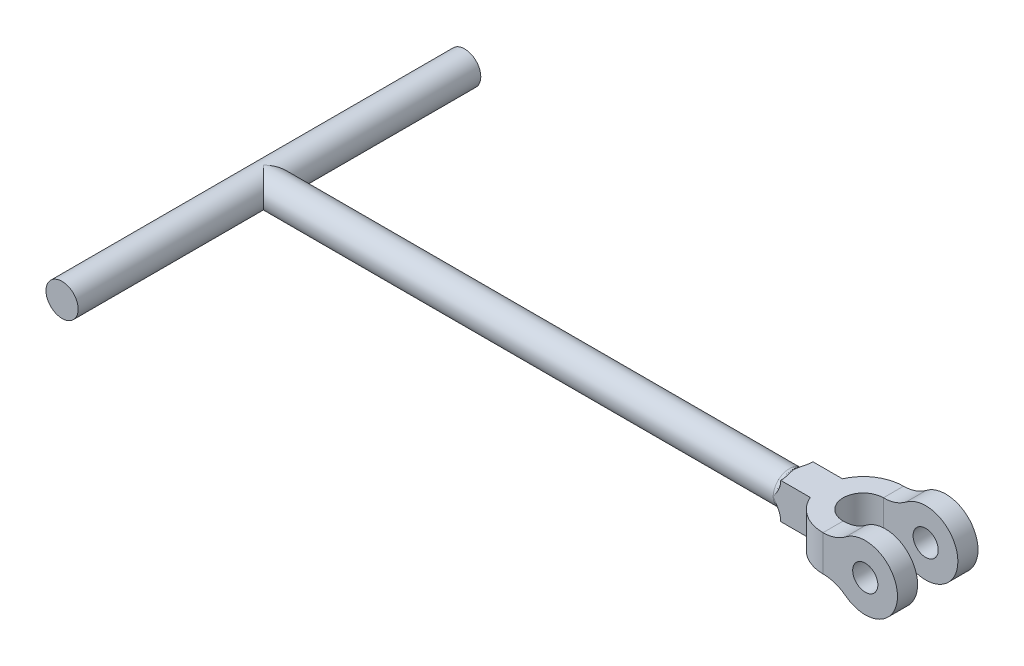
ISO-10303-21;
HEADER;
FILE_DESCRIPTION(('STEP AP214'),'2;1');
FILE_NAME('part.step','',(''),(''),'','','');
FILE_SCHEMA(('AUTOMOTIVE_DESIGN { 1 0 10303 214 1 1 1 1 }'));
ENDSEC;
DATA;
#1=APPLICATION_CONTEXT('core data for automotive mechanical design processes');
#2=APPLICATION_PROTOCOL_DEFINITION('international standard','automotive_design',2000,#1);
#3=PRODUCT_CONTEXT('',#1,'mechanical');
#4=PRODUCT('Part','Part','',(#3));
#5=PRODUCT_RELATED_PRODUCT_CATEGORY('part','',(#4));
#6=PRODUCT_DEFINITION_FORMATION('','',#4);
#7=PRODUCT_DEFINITION_CONTEXT('part definition',#1,'design');
#8=PRODUCT_DEFINITION('design','',#6,#7);
#9=PRODUCT_DEFINITION_SHAPE('','',#8);
#10=(LENGTH_UNIT() NAMED_UNIT(*) SI_UNIT(.MILLI.,.METRE.));
#11=(NAMED_UNIT(*) PLANE_ANGLE_UNIT() SI_UNIT($,.RADIAN.));
#12=(NAMED_UNIT(*) SI_UNIT($,.STERADIAN.) SOLID_ANGLE_UNIT());
#13=UNCERTAINTY_MEASURE_WITH_UNIT(LENGTH_MEASURE(1.E-05),#10,'distance_accuracy_value','');
#14=(GEOMETRIC_REPRESENTATION_CONTEXT(3) GLOBAL_UNCERTAINTY_ASSIGNED_CONTEXT((#13)) GLOBAL_UNIT_ASSIGNED_CONTEXT((#10,
#11,#12)) REPRESENTATION_CONTEXT('',''));
#15=CARTESIAN_POINT('',(0.,0.,0.));
#16=DIRECTION('',(0.,0.,1.));
#17=DIRECTION('',(1.,0.,0.));
#18=AXIS2_PLACEMENT_3D('',#15,#16,#17);
#19=CARTESIAN_POINT('',(-96.,17.75,0.));
#20=DIRECTION('',(1.,0.,0.));
#21=DIRECTION('',(0.,0.,-1.));
#22=AXIS2_PLACEMENT_3D('',#19,#20,#21);
#23=CYLINDRICAL_SURFACE('',#22,16.);
#24=CARTESIAN_POINT('',(-73.5,17.75,0.));
#25=DIRECTION('',(1.,0.,0.));
#26=DIRECTION('',(0.,0.,-1.));
#27=AXIS2_PLACEMENT_3D('',#24,#25,#26);
#28=CIRCLE('',#27,16.);
#29=CARTESIAN_POINT('',(-73.5,29.8351063829787,-10.4857142680929));
#30=VERTEX_POINT('',#29);
#31=CARTESIAN_POINT('',(-73.5,17.75,-16.));
#32=VERTEX_POINT('',#31);
#33=EDGE_CURVE('E359',#30,#32,#28,.F.);
#34=ORIENTED_EDGE('',*,*,#33,.T.);
#35=CARTESIAN_POINT('',(-73.5,17.75,0.));
#36=DIRECTION('',(1.,0.,0.));
#37=DIRECTION('',(0.,0.,-1.));
#38=AXIS2_PLACEMENT_3D('',#35,#36,#37);
#39=CIRCLE('',#38,16.);
#40=CARTESIAN_POINT('',(-73.5,17.75,16.));
#41=VERTEX_POINT('',#40);
#42=EDGE_CURVE('E403',#32,#41,#39,.F.);
#43=ORIENTED_EDGE('',*,*,#42,.T.);
#44=CARTESIAN_POINT('',(-73.5,17.75,0.));
#45=DIRECTION('',(1.,0.,0.));
#46=DIRECTION('',(0.,0.,-1.));
#47=AXIS2_PLACEMENT_3D('',#44,#45,#46);
#48=CIRCLE('',#47,16.);
#49=EDGE_CURVE('E355',#41,#30,#48,.F.);
#50=ORIENTED_EDGE('',*,*,#49,.T.);
#51=EDGE_LOOP('',(#34,#43,#50));
#52=FACE_BOUND('',#51,.T.);
#53=CARTESIAN_POINT('',(-596.,17.75,2.54136989230602E-13));
#54=DIRECTION('',(0.707106781186547,0.,-0.707106781186548));
#55=DIRECTION('',(0.707106781186548,0.,0.707106781186547));
#56=AXIS2_PLACEMENT_3D('',#53,#54,#55);
#57=ELLIPSE('',#56,22.6274169979695,16.);
#58=CARTESIAN_POINT('',(-596.,1.75000000000003,2.4980018054066E-13));
#59=VERTEX_POINT('',#58);
#60=CARTESIAN_POINT('',(-596.,33.75,2.58473797920544E-13));
#61=VERTEX_POINT('',#60);
#62=EDGE_CURVE('E173',#59,#61,#57,.F.);
#63=ORIENTED_EDGE('',*,*,#62,.F.);
#64=CARTESIAN_POINT('',(-596.,17.75,2.54136989230602E-13));
#65=DIRECTION('',(0.707106781186548,0.,0.707106781186547));
#66=DIRECTION('',(0.707106781186547,0.,-0.707106781186548));
#67=AXIS2_PLACEMENT_3D('',#64,#65,#66);
#68=ELLIPSE('',#67,22.6274169979695,16.);
#69=EDGE_CURVE('E64',#61,#59,#68,.F.);
#70=ORIENTED_EDGE('',*,*,#69,.F.);
#71=EDGE_LOOP('',(#63,#70));
#72=FACE_BOUND('',#71,.T.);
#73=ADVANCED_FACE('F43',(#52,#72),#23,.T.);
#74=CARTESIAN_POINT('',(-73.5,17.75,0.));
#75=DIRECTION('',(1.,0.,0.));
#76=DIRECTION('',(0.,0.,-1.));
#77=AXIS2_PLACEMENT_3D('',#74,#75,#76);
#78=TOROIDAL_SURFACE('',#77,23.5,7.5);
#79=CARTESIAN_POINT('',(-66.,0.,15.4008928312615));
#80=CARTESIAN_POINT('',(-66.0000318023038,0.,14.8804115279279));
#81=CARTESIAN_POINT('',(-66.0232421290868,0.,14.3605790569439));
#82=CARTESIAN_POINT('',(-66.1081118865129,0.,13.3248495363233));
#83=CARTESIAN_POINT('',(-66.1697064153088,0.,12.808947328635));
#84=CARTESIAN_POINT('',(-66.3249199775155,0.,11.7723967458196));
#85=CARTESIAN_POINT('',(-66.4191134174114,0.,11.2518386026303));
#86=CARTESIAN_POINT('',(-66.6310759562392,0.,10.2155511707945));
#87=CARTESIAN_POINT('',(-66.748849536139,0.,9.69982281948884));
#88=CARTESIAN_POINT('',(-66.980504953852,0.,8.74942261622406));
#89=CARTESIAN_POINT('',(-67.0923061571591,0.,8.3142301774926));
#90=CARTESIAN_POINT('',(-67.3208962118078,0.,7.44514278697411));
#91=CARTESIAN_POINT('',(-67.4376854372865,0.,7.0112479351364));
#92=CARTESIAN_POINT('',(-67.66971628205,0.,6.14245178812685));
#93=CARTESIAN_POINT('',(-67.7849557813362,0.,5.7075499129907));
#94=CARTESIAN_POINT('',(-68.0057969348732,0.,4.83520444025799));
#95=CARTESIAN_POINT('',(-68.1113976406471,0.,4.39776059702188));
#96=CARTESIAN_POINT('',(-68.3012410377478,0.,3.5289026092728));
#97=CARTESIAN_POINT('',(-68.3859296587516,0.,3.09759042482606));
#98=CARTESIAN_POINT('',(-68.4921825004679,0.,2.4472500421156));
#99=CARTESIAN_POINT('',(-68.5241351172993,0.,2.22992464101352));
#100=CARTESIAN_POINT('',(-68.580031572255,0.,1.79425590315082));
#101=CARTESIAN_POINT('',(-68.6039762812246,0.,1.57591267969669));
#102=CARTESIAN_POINT('',(-68.642877661863,0.,1.13921693897396));
#103=CARTESIAN_POINT('',(-68.6578666663174,0.,0.920867336460486));
#104=CARTESIAN_POINT('',(-68.6783828273923,0.,0.483717759812868));
#105=CARTESIAN_POINT('',(-68.6839099716776,0.,0.264917785091952));
#106=CARTESIAN_POINT('',(-68.685266886859,0.,-0.172707607674446));
#107=CARTESIAN_POINT('',(-68.6810969054587,0.,-0.391533024927247));
#108=CARTESIAN_POINT('',(-68.6632403592593,0.,-0.828779650988105));
#109=CARTESIAN_POINT('',(-68.6495541414388,0.,-1.04720087424265));
#110=CARTESIAN_POINT('',(-68.6091042409076,0.,-1.53266984290301));
#111=CARTESIAN_POINT('',(-68.5800810764188,0.,-1.79952914195572));
#112=CARTESIAN_POINT('',(-68.510197221665,0.,-2.33162624017202));
#113=CARTESIAN_POINT('',(-68.4693380036541,0.,-2.59686423681762));
#114=CARTESIAN_POINT('',(-68.3777261065161,0.,-3.12619414766387));
#115=CARTESIAN_POINT('',(-68.3269521416921,0.,-3.39028232369009));
#116=CARTESIAN_POINT('',(-68.217741284752,0.,-3.91685724088286));
#117=CARTESIAN_POINT('',(-68.159304119703,0.,-4.17934392466198));
#118=CARTESIAN_POINT('',(-68.0356870934936,0.,-4.70812420837128));
#119=CARTESIAN_POINT('',(-67.9703977561242,0.,-4.97439192300044));
#120=CARTESIAN_POINT('',(-67.8361288430587,0.,-5.50598255092246));
#121=CARTESIAN_POINT('',(-67.7671493040497,0.,-5.77130547358025));
#122=CARTESIAN_POINT('',(-67.6274306153857,0.,-6.30124759880482));
#123=CARTESIAN_POINT('',(-67.5566929767522,0.,-6.56586720310252));
#124=CARTESIAN_POINT('',(-67.4150795900988,0.,-7.09506944346952));
#125=CARTESIAN_POINT('',(-67.3442038415767,0.,-7.35965207940065));
#126=CARTESIAN_POINT('',(-67.1951607858698,0.,-7.92189564390278));
#127=CARTESIAN_POINT('',(-67.1171743097998,0.,-8.21960523746512));
#128=CARTESIAN_POINT('',(-66.964895115067,0.,-8.81596427977908));
#129=CARTESIAN_POINT('',(-66.8906023785395,0.,-9.1146137239777));
#130=CARTESIAN_POINT('',(-66.6759428035398,0.,-10.0127757147645));
#131=CARTESIAN_POINT('',(-66.5438406161752,0.,-10.6143365876824));
#132=CARTESIAN_POINT('',(-66.316643111206,0.,-11.8161813447402));
#133=CARTESIAN_POINT('',(-66.2210677237878,0.,-12.4163707840733));
#134=CARTESIAN_POINT('',(-66.0767821461099,0.,-13.6222065429027));
#135=CARTESIAN_POINT('',(-66.0280449458546,0.,-14.2278495138802));
#136=CARTESIAN_POINT('',(-65.9873989377953,0.,-15.5223054349925));
#137=CARTESIAN_POINT('',(-66.0038815495804,0.,-16.211498914849));
#138=CARTESIAN_POINT('',(-66.1002815084626,0.,-17.2445427915309));
#139=CARTESIAN_POINT('',(-66.1450646661702,0.,-17.591746516269));
#140=CARTESIAN_POINT('',(-66.2617241135336,0.,-18.2820799720931));
#141=CARTESIAN_POINT('',(-66.3336416538249,0.,-18.6252026756827));
#142=CARTESIAN_POINT('',(-66.4203362118473,0.,-18.9648841961865));
#143=B_SPLINE_CURVE_WITH_KNOTS('',3,(#79,#80,#81,#82,#83,#84,#85,#86,#87,#88,#89,#90,#91,#92,
#93,#94,#95,#96,#97,#98,#99,#100,#101,#102,#103,#104,#105,#106,#107,#108,#109,#110,#111,#112,
#113,#114,#115,#116,#117,#118,#119,#120,#121,#122,#123,#124,#125,#126,#127,#128,#129,#130,#131,
#132,#133,#134,#135,#136,#137,#138,#139,#140,#141,#142),.UNSPECIFIED.,.F.,.F.,(4,2,2,2,2,2,2,2,
2,2,2,2,2,2,2,2,2,2,2,2,2,2,2,2,2,2,2,2,2,2,2,4),(0.,1.56000017940334,3.11736976603774,
4.70370956666008,6.29035110831758,7.63826642291521,8.98628301890779,10.3359868394177,
11.6858233306618,13.0037462948952,13.6626070403594,14.3213961125971,14.9777921565568,
15.634189056243,16.290569189089,16.9469253904172,17.7519052159296,18.556784955176,
19.3634120529026,20.170067887294,20.992492274497,21.8149084868714,22.6366407665604,
23.4583760396232,24.3816216755832,25.3048628458463,27.1518598189369,28.9736707385696,
30.7944304500574,32.8565978470415,33.905876140512,34.956756053112),.UNSPECIFIED.);
#144=CARTESIAN_POINT('',(-66.,0.,15.4008928312615));
#145=VERTEX_POINT('',#144);
#146=CARTESIAN_POINT('',(-66.,0.,-15.4008928312614));
#147=VERTEX_POINT('',#146);
#148=EDGE_CURVE('E396',#145,#147,#143,.T.);
#149=ORIENTED_EDGE('',*,*,#148,.F.);
#150=CARTESIAN_POINT('',(-66.,17.75,0.));
#151=DIRECTION('',(1.,0.,0.));
#152=DIRECTION('',(0.,0.,-1.));
#153=AXIS2_PLACEMENT_3D('',#150,#151,#152);
#154=CIRCLE('',#153,23.5);
#155=CARTESIAN_POINT('',(-66.,0.538085521941473,16.));
#156=VERTEX_POINT('',#155);
#157=EDGE_CURVE('E426',#156,#145,#154,.T.);
#158=ORIENTED_EDGE('',*,*,#157,.F.);
#159=CARTESIAN_POINT('',(-66.,0.538085521941473,16.));
#160=CARTESIAN_POINT('',(-66.0000377689396,1.00016842260866,16.));
#161=CARTESIAN_POINT('',(-66.0228927360209,1.46178647270298,16.));
#162=CARTESIAN_POINT('',(-66.1092220185612,2.38036181063382,16.));
#163=CARTESIAN_POINT('',(-66.1726164006055,2.83732647642499,16.));
#164=CARTESIAN_POINT('',(-66.333617997605,3.73671185793217,16.));
#165=CARTESIAN_POINT('',(-66.4306029457875,4.17924697725201,16.));
#166=CARTESIAN_POINT('',(-66.6547296331058,5.05676315942903,16.));
#167=CARTESIAN_POINT('',(-66.7818861741718,5.49174040168725,16.));
#168=CARTESIAN_POINT('',(-67.0959496714085,6.45631626876657,16.));
#169=CARTESIAN_POINT('',(-67.2898730591803,6.98362027030848,16.));
#170=CARTESIAN_POINT('',(-67.7110842399745,8.02484474667585,16.));
#171=CARTESIAN_POINT('',(-67.938387698479,8.53875880344787,16.));
#172=CARTESIAN_POINT('',(-68.4205544766813,9.55443918313024,16.));
#173=CARTESIAN_POINT('',(-68.6754632112109,10.0561837737627,16.));
#174=CARTESIAN_POINT('',(-69.2069770502382,11.0478698338466,16.));
#175=CARTESIAN_POINT('',(-69.4835792613762,11.5378128659715,16.));
#176=CARTESIAN_POINT('',(-70.3438417035465,13.001932274059,16.));
#177=CARTESIAN_POINT('',(-70.9532194674221,13.9608815531865,16.0000000000001));
#178=CARTESIAN_POINT('',(-72.20360947692,15.8562716536274,15.9999999999999));
#179=CARTESIAN_POINT('',(-72.8446009215682,16.7927266878886,15.9999999999995));
#180=CARTESIAN_POINT('',(-73.4904721387591,17.736083666427,16.));
#181=CARTESIAN_POINT('',(-73.4952360694397,17.7430418325346,16.));
#182=CARTESIAN_POINT('',(-73.5,17.75,16.));
#183=B_SPLINE_CURVE_WITH_KNOTS('',3,(#159,#160,#161,#162,#163,#164,#165,#166,#167,#168,#169,
#170,#171,#172,#173,#174,#175,#176,#177,#178,#179,#180,#181,#182),.UNSPECIFIED.,.F.,.F.,(4,2,2,
2,2,2,2,2,2,2,2,4),(0.,1.38501867528732,2.76731483125574,4.12526422260894,5.48388119498472,
7.16795908207809,8.85282985860789,10.540515864966,12.2279771583539,15.6347092668108,
19.0392289851502,19.0645272064318),.UNSPECIFIED.);
#184=EDGE_CURVE('E58',#156,#41,#183,.T.);
#185=ORIENTED_EDGE('',*,*,#184,.T.);
#186=ORIENTED_EDGE('',*,*,#42,.F.);
#187=CARTESIAN_POINT('',(-66.,0.538085521941515,-16.));
#188=CARTESIAN_POINT('',(-66.0000377689396,1.00016842257633,-16.));
#189=CARTESIAN_POINT('',(-66.0228927360177,1.4617864726384,-16.));
#190=CARTESIAN_POINT('',(-66.1092220185469,2.38036181051253,-16.));
#191=CARTESIAN_POINT('',(-66.172616400584,2.83732647627918,-16.));
#192=CARTESIAN_POINT('',(-66.3336179975758,3.73671185779374,-16.));
#193=CARTESIAN_POINT('',(-66.4306029457619,4.17924697714469,-16.));
#194=CARTESIAN_POINT('',(-66.654729633091,5.05676315937838,-16.));
#195=CARTESIAN_POINT('',(-66.7818861741636,5.49174040166226,-16.));
#196=CARTESIAN_POINT('',(-67.0959496714101,6.45631626877129,-16.));
#197=CARTESIAN_POINT('',(-67.2898730591841,6.98362027031759,-16.));
#198=CARTESIAN_POINT('',(-67.7110842399823,8.02484474669548,-16.));
#199=CARTESIAN_POINT('',(-67.9383876984887,8.53875880347361,-16.));
#200=CARTESIAN_POINT('',(-68.4205544767055,9.55443918317596,-16.));
#201=CARTESIAN_POINT('',(-68.6754632112485,10.056183773822,-16.));
#202=CARTESIAN_POINT('',(-69.206977050284,11.0478698339428,-16.));
#203=CARTESIAN_POINT('',(-69.4835792614167,11.5378128660911,-16.));
#204=CARTESIAN_POINT('',(-70.3438417036505,13.0019322741342,-16.));
#205=CARTESIAN_POINT('',(-70.9532194676982,13.9608815531227,-15.9999999999998));
#206=CARTESIAN_POINT('',(-72.2036094767323,15.8562716538254,-16.0000000000002));
#207=CARTESIAN_POINT('',(-72.8446009207447,16.7927266884872,-16.0000000000006));
#208=CARTESIAN_POINT('',(-73.4904721387467,17.7360836664356,-16.));
#209=CARTESIAN_POINT('',(-73.4952360694335,17.7430418325389,-16.));
#210=CARTESIAN_POINT('',(-73.5,17.75,-16.));
#211=B_SPLINE_CURVE_WITH_KNOTS('',3,(#187,#188,#189,#190,#191,#192,#193,#194,#195,#196,#197,
#198,#199,#200,#201,#202,#203,#204,#205,#206,#207,#208,#209,#210),.UNSPECIFIED.,.F.,.F.,(4,2,2,
2,2,2,2,2,2,2,2,4),(0.,1.38501867519049,2.76731483108334,4.12526422252981,5.4838811949848,
7.167959082093,8.85282985864112,10.5405158650554,12.2279771584922,15.6347092668967,
19.0392289851505,19.0645272064319),.UNSPECIFIED.);
#212=CARTESIAN_POINT('',(-66.,0.538085521941515,-16.));
#213=VERTEX_POINT('',#212);
#214=EDGE_CURVE('E11',#32,#213,#211,.F.);
#215=ORIENTED_EDGE('',*,*,#214,.T.);
#216=CARTESIAN_POINT('',(-66.,17.75,0.));
#217=DIRECTION('',(1.,0.,0.));
#218=DIRECTION('',(0.,0.,-1.));
#219=AXIS2_PLACEMENT_3D('',#216,#217,#218);
#220=CIRCLE('',#219,23.5);
#221=EDGE_CURVE('E423',#147,#213,#220,.T.);
#222=ORIENTED_EDGE('',*,*,#221,.F.);
#223=EDGE_LOOP('',(#149,#158,#185,#186,#215,#222));
#224=FACE_BOUND('',#223,.T.);
#225=ADVANCED_FACE('F45',(#224),#78,.F.);
#226=CARTESIAN_POINT('',(-66.,35.5,-16.));
#227=DIRECTION('',(1.,0.,0.));
#228=DIRECTION('',(0.,0.,-1.));
#229=AXIS2_PLACEMENT_3D('',#226,#227,#228);
#230=PLANE('',#229);
#231=DIRECTION('',(0.,-1.,0.));
#232=VECTOR('',#231,1.);
#233=CARTESIAN_POINT('',(-66.,35.5,16.));
#234=LINE('',#233,#232);
#235=CARTESIAN_POINT('',(-66.,0.,16.));
#236=VERTEX_POINT('',#235);
#237=EDGE_CURVE('E325',#156,#236,#234,.T.);
#238=ORIENTED_EDGE('',*,*,#237,.F.);
#239=ORIENTED_EDGE('',*,*,#157,.T.);
#240=DIRECTION('',(0.,0.,1.));
#241=VECTOR('',#240,1.);
#242=CARTESIAN_POINT('',(-66.,0.,-16.));
#243=LINE('',#242,#241);
#244=EDGE_CURVE('E300',#145,#236,#243,.T.);
#245=ORIENTED_EDGE('',*,*,#244,.T.);
#246=EDGE_LOOP('',(#238,#239,#245));
#247=FACE_BOUND('',#246,.T.);
#248=ADVANCED_FACE('F510',(#247),#230,.F.);
#249=CARTESIAN_POINT('',(-73.5,17.75,0.));
#250=DIRECTION('',(1.,0.,0.));
#251=DIRECTION('',(0.,0.,-1.));
#252=AXIS2_PLACEMENT_3D('',#249,#250,#251);
#253=TOROIDAL_SURFACE('',#252,23.5,7.5);
#254=CARTESIAN_POINT('',(-66.,35.5,-15.4008928312614));
#255=CARTESIAN_POINT('',(-66.0000318023038,35.5,-14.8804115279278));
#256=CARTESIAN_POINT('',(-66.0232421290868,35.5,-14.3605790569439));
#257=CARTESIAN_POINT('',(-66.108111886513,35.5,-13.3248495363233));
#258=CARTESIAN_POINT('',(-66.1697064153088,35.5,-12.8089473286349));
#259=CARTESIAN_POINT('',(-66.3249199775155,35.5,-11.7723967458196));
#260=CARTESIAN_POINT('',(-66.4191134174114,35.5,-11.2518386026302));
#261=CARTESIAN_POINT('',(-66.6310759562392,35.5,-10.2155511707944));
#262=CARTESIAN_POINT('',(-66.748849536139,35.5,-9.6998228194888));
#263=CARTESIAN_POINT('',(-66.980504953852,35.5,-8.74942261622402));
#264=CARTESIAN_POINT('',(-67.0923061571591,35.5,-8.31423017749256));
#265=CARTESIAN_POINT('',(-67.3208962118078,35.5,-7.44514278697407));
#266=CARTESIAN_POINT('',(-67.4376854372865,35.5,-7.01124793513635));
#267=CARTESIAN_POINT('',(-67.66971628205,35.5,-6.1424517881268));
#268=CARTESIAN_POINT('',(-67.7849557813362,35.5,-5.70754991299066));
#269=CARTESIAN_POINT('',(-68.0057969348732,35.5,-4.83520444025795));
#270=CARTESIAN_POINT('',(-68.1113976406471,35.5,-4.39776059702184));
#271=CARTESIAN_POINT('',(-68.3012410377478,35.5,-3.52890260927276));
#272=CARTESIAN_POINT('',(-68.3859296587516,35.5,-3.09759042482602));
#273=CARTESIAN_POINT('',(-68.4921825004679,35.5,-2.44725004211555));
#274=CARTESIAN_POINT('',(-68.5241351172993,35.5,-2.22992464101347));
#275=CARTESIAN_POINT('',(-68.580031572255,35.5,-1.79425590315078));
#276=CARTESIAN_POINT('',(-68.6039762812246,35.5,-1.57591267969665));
#277=CARTESIAN_POINT('',(-68.642877661863,35.5,-1.13921693897392));
#278=CARTESIAN_POINT('',(-68.6578666663174,35.5,-0.920867336460447));
#279=CARTESIAN_POINT('',(-68.6783828273923,35.5,-0.483717759812829));
#280=CARTESIAN_POINT('',(-68.6839099716776,35.5,-0.264917785091914));
#281=CARTESIAN_POINT('',(-68.685266886859,35.5,0.172707607674483));
#282=CARTESIAN_POINT('',(-68.6810969054587,35.5,0.391533024927283));
#283=CARTESIAN_POINT('',(-68.6632403592593,35.5,0.828779650988141));
#284=CARTESIAN_POINT('',(-68.6495541414388,35.5,1.04720087424269));
#285=CARTESIAN_POINT('',(-68.6091042409076,35.5,1.53266984290304));
#286=CARTESIAN_POINT('',(-68.5800810764188,35.5,1.79952914195576));
#287=CARTESIAN_POINT('',(-68.510197221665,35.5,2.33162624017205));
#288=CARTESIAN_POINT('',(-68.4693380036541,35.5,2.59686423681764));
#289=CARTESIAN_POINT('',(-68.3777261065161,35.5,3.12619414766389));
#290=CARTESIAN_POINT('',(-68.3269521416921,35.5,3.39028232369011));
#291=CARTESIAN_POINT('',(-68.217741284752,35.5,3.91685724088287));
#292=CARTESIAN_POINT('',(-68.159304119703,35.5,4.17934392466198));
#293=CARTESIAN_POINT('',(-68.0356870934936,35.5,4.70812420837128));
#294=CARTESIAN_POINT('',(-67.9703977561242,35.5,4.97439192300044));
#295=CARTESIAN_POINT('',(-67.8361288430587,35.5,5.50598255092244));
#296=CARTESIAN_POINT('',(-67.7671493040497,35.5,5.77130547358023));
#297=CARTESIAN_POINT('',(-67.6274306153857,35.5,6.30124759880479));
#298=CARTESIAN_POINT('',(-67.5566929767522,35.5,6.56586720310249));
#299=CARTESIAN_POINT('',(-67.4150795900988,35.5,7.09506944346949));
#300=CARTESIAN_POINT('',(-67.3442038415767,35.5,7.35965207940061));
#301=CARTESIAN_POINT('',(-67.1951607858699,35.5,7.92189564390273));
#302=CARTESIAN_POINT('',(-67.1171743097998,35.5,8.21960523746507));
#303=CARTESIAN_POINT('',(-66.964895115067,35.5,8.81596427977902));
#304=CARTESIAN_POINT('',(-66.8906023785395,35.5,9.11461372397763));
#305=CARTESIAN_POINT('',(-66.6759428035398,35.5,10.0127757147645));
#306=CARTESIAN_POINT('',(-66.5438406161752,35.5,10.6143365876823));
#307=CARTESIAN_POINT('',(-66.316643111206,35.5,11.8161813447401));
#308=CARTESIAN_POINT('',(-66.2210677237879,35.5,12.4163707840732));
#309=CARTESIAN_POINT('',(-66.0767821461099,35.5,13.6222065429025));
#310=CARTESIAN_POINT('',(-66.0280449458546,35.5,14.2278495138801));
#311=CARTESIAN_POINT('',(-65.9873989377953,35.5,15.5223054349924));
#312=CARTESIAN_POINT('',(-66.0038815495804,35.5,16.2114989148489));
#313=CARTESIAN_POINT('',(-66.1002815084625,35.5,17.2445427915308));
#314=CARTESIAN_POINT('',(-66.1450646661701,35.5,17.5917465162689));
#315=CARTESIAN_POINT('',(-66.2617241135335,35.5,18.2820799720931));
#316=CARTESIAN_POINT('',(-66.3336416538248,35.5,18.6252026756826));
#317=CARTESIAN_POINT('',(-66.4203362118472,35.5,18.9648841961864));
#318=B_SPLINE_CURVE_WITH_KNOTS('',3,(#254,#255,#256,#257,#258,#259,#260,#261,#262,#263,#264,
#265,#266,#267,#268,#269,#270,#271,#272,#273,#274,#275,#276,#277,#278,#279,#280,#281,#282,#283,
#284,#285,#286,#287,#288,#289,#290,#291,#292,#293,#294,#295,#296,#297,#298,#299,#300,#301,#302,
#303,#304,#305,#306,#307,#308,#309,#310,#311,#312,#313,#314,#315,#316,#317),.UNSPECIFIED.,.F.,
.F.,(4,2,2,2,2,2,2,2,2,2,2,2,2,2,2,2,2,2,2,2,2,2,2,2,2,2,2,2,2,2,2,4),(0.,1.56000017940334,
3.11736976603773,4.70370956666007,6.29035110831756,7.63826642291519,8.98628301890778,
10.3359868394176,11.6858233306618,13.0037462948952,13.6626070403594,14.3213961125971,
14.9777921565568,15.634189056243,16.290569189089,16.9469253904172,17.7519052159296,
18.556784955176,19.3634120529026,20.170067887294,20.9924922744969,21.8149084868713,
22.6366407665603,23.4583760396231,24.3816216755831,25.3048628458462,27.1518598189368,
28.9736707385694,30.7944304500571,32.8565978470413,33.9058761405119,34.9567560531119),.UNSPECIFIED.);
#319=CARTESIAN_POINT('',(-66.,35.5,-15.4008928312614));
#320=VERTEX_POINT('',#319);
#321=CARTESIAN_POINT('',(-66.,35.5,15.4008928312615));
#322=VERTEX_POINT('',#321);
#323=EDGE_CURVE('E363',#320,#322,#318,.T.);
#324=ORIENTED_EDGE('',*,*,#323,.F.);
#325=CARTESIAN_POINT('',(-66.,17.75,0.));
#326=DIRECTION('',(1.,0.,0.));
#327=DIRECTION('',(0.,0.,-1.));
#328=AXIS2_PLACEMENT_3D('',#325,#326,#327);
#329=CIRCLE('',#328,23.5);
#330=CARTESIAN_POINT('',(-66.,34.9619144780585,-16.));
#331=VERTEX_POINT('',#330);
#332=EDGE_CURVE('E351',#331,#320,#329,.T.);
#333=ORIENTED_EDGE('',*,*,#332,.F.);
#334=CARTESIAN_POINT('',(-66.,34.9619144780585,-16.));
#335=CARTESIAN_POINT('',(-66.0000377689396,34.4998315774236,-16.));
#336=CARTESIAN_POINT('',(-66.0228927360177,34.0382135273616,-16.));
#337=CARTESIAN_POINT('',(-66.1092220185469,33.1196381894874,-16.));
#338=CARTESIAN_POINT('',(-66.172616400584,32.6626735237208,-16.));
#339=CARTESIAN_POINT('',(-66.3336179975758,31.7632881422062,-16.));
#340=CARTESIAN_POINT('',(-66.4306029457619,31.3207530228553,-16.));
#341=CARTESIAN_POINT('',(-66.654729633091,30.4432368406216,-16.));
#342=CARTESIAN_POINT('',(-66.7818861741636,30.0082595983377,-16.));
#343=CARTESIAN_POINT('',(-67.0959496714101,29.0436837312287,-16.));
#344=CARTESIAN_POINT('',(-67.2898730591841,28.5163797296824,-16.));
#345=CARTESIAN_POINT('',(-67.7110842399823,27.4751552533045,-16.));
#346=CARTESIAN_POINT('',(-67.9383876984887,26.9612411965264,-16.));
#347=CARTESIAN_POINT('',(-68.4205544767055,25.945560816824,-16.));
#348=CARTESIAN_POINT('',(-68.6754632112485,25.443816226178,-16.));
#349=CARTESIAN_POINT('',(-69.206977050284,24.4521301660572,-16.));
#350=CARTESIAN_POINT('',(-69.4835792614167,23.9621871339089,-16.));
#351=CARTESIAN_POINT('',(-70.3438417036505,22.4980677258658,-16.));
#352=CARTESIAN_POINT('',(-70.9532194676982,21.5391184468772,-15.9999999999998));
#353=CARTESIAN_POINT('',(-72.2036094767323,19.6437283461746,-16.0000000000002));
#354=CARTESIAN_POINT('',(-72.8446009207448,18.7072733115129,-16.0000000000006));
#355=CARTESIAN_POINT('',(-73.4904721387467,17.7639163335644,-16.));
#356=CARTESIAN_POINT('',(-73.4952360694335,17.7569581674611,-16.));
#357=CARTESIAN_POINT('',(-73.5,17.75,-16.));
#358=B_SPLINE_CURVE_WITH_KNOTS('',3,(#334,#335,#336,#337,#338,#339,#340,#341,#342,#343,#344,
#345,#346,#347,#348,#349,#350,#351,#352,#353,#354,#355,#356,#357),.UNSPECIFIED.,.F.,.F.,(4,2,2,
2,2,2,2,2,2,2,2,4),(0.,1.38501867519051,2.76731483108337,4.12526422252983,5.48388119498481,
7.16795908209301,8.85282985864112,10.5405158650554,12.2279771584922,15.6347092668967,
19.0392289851505,19.0645272064319),.UNSPECIFIED.);
#359=EDGE_CURVE('E371',#331,#32,#358,.T.);
#360=ORIENTED_EDGE('',*,*,#359,.T.);
#361=ORIENTED_EDGE('',*,*,#33,.F.);
#362=ORIENTED_EDGE('',*,*,#49,.F.);
#363=CARTESIAN_POINT('',(-66.,34.9619144780585,16.));
#364=CARTESIAN_POINT('',(-66.0000377689396,34.4998315773913,16.));
#365=CARTESIAN_POINT('',(-66.0228927360209,34.038213527297,16.));
#366=CARTESIAN_POINT('',(-66.1092220185612,33.1196381893662,16.));
#367=CARTESIAN_POINT('',(-66.1726164006055,32.662673523575,16.));
#368=CARTESIAN_POINT('',(-66.3336179976051,31.7632881420678,16.));
#369=CARTESIAN_POINT('',(-66.4306029457875,31.320753022748,16.));
#370=CARTESIAN_POINT('',(-66.6547296331058,30.443236840571,16.));
#371=CARTESIAN_POINT('',(-66.7818861741718,30.0082595983127,16.));
#372=CARTESIAN_POINT('',(-67.0959496714085,29.0436837312334,16.));
#373=CARTESIAN_POINT('',(-67.2898730591803,28.5163797296915,16.));
#374=CARTESIAN_POINT('',(-67.7110842399745,27.4751552533241,16.));
#375=CARTESIAN_POINT('',(-67.938387698479,26.9612411965521,16.));
#376=CARTESIAN_POINT('',(-68.4205544766813,25.9455608168697,16.));
#377=CARTESIAN_POINT('',(-68.6754632112109,25.4438162262373,16.));
#378=CARTESIAN_POINT('',(-69.2069770502383,24.4521301661534,16.));
#379=CARTESIAN_POINT('',(-69.4835792613762,23.9621871340285,16.));
#380=CARTESIAN_POINT('',(-70.3438417035466,22.498067725941,16.));
#381=CARTESIAN_POINT('',(-70.9532194674221,21.5391184468134,16.0000000000001));
#382=CARTESIAN_POINT('',(-72.20360947692,19.6437283463726,15.9999999999999));
#383=CARTESIAN_POINT('',(-72.8446009215682,18.7072733121114,15.9999999999995));
#384=CARTESIAN_POINT('',(-73.4904721387591,17.763916333573,16.));
#385=CARTESIAN_POINT('',(-73.4952360694397,17.7569581674654,16.));
#386=CARTESIAN_POINT('',(-73.5,17.75,16.));
#387=B_SPLINE_CURVE_WITH_KNOTS('',3,(#363,#364,#365,#366,#367,#368,#369,#370,#371,#372,#373,
#374,#375,#376,#377,#378,#379,#380,#381,#382,#383,#384,#385,#386),.UNSPECIFIED.,.F.,.F.,(4,2,2,
2,2,2,2,2,2,2,2,4),(0.,1.38501867528732,2.76731483125576,4.12526422260895,5.48388119498473,
7.1679590820781,8.8528298586079,10.5405158649661,12.2279771583539,15.6347092668108,
19.0392289851502,19.0645272064318),.UNSPECIFIED.);
#388=CARTESIAN_POINT('',(-66.,34.9619144780585,16.));
#389=VERTEX_POINT('',#388);
#390=EDGE_CURVE('E416',#41,#389,#387,.F.);
#391=ORIENTED_EDGE('',*,*,#390,.T.);
#392=CARTESIAN_POINT('',(-66.,17.75,0.));
#393=DIRECTION('',(1.,0.,0.));
#394=DIRECTION('',(0.,0.,-1.));
#395=AXIS2_PLACEMENT_3D('',#392,#393,#394);
#396=CIRCLE('',#395,23.5);
#397=EDGE_CURVE('E347',#322,#389,#396,.T.);
#398=ORIENTED_EDGE('',*,*,#397,.F.);
#399=EDGE_LOOP('',(#324,#333,#360,#361,#362,#391,#398));
#400=FACE_BOUND('',#399,.T.);
#401=ADVANCED_FACE('F377',(#400),#253,.F.);
#402=DIRECTION('',(0.,-1.,0.));
#403=VECTOR('',#402,1.);
#404=CARTESIAN_POINT('',(-66.,35.5,-16.));
#405=LINE('',#404,#403);
#406=CARTESIAN_POINT('',(-66.,35.5,-16.));
#407=VERTEX_POINT('',#406);
#408=EDGE_CURVE('E331',#407,#331,#405,.T.);
#409=ORIENTED_EDGE('',*,*,#408,.T.);
#410=ORIENTED_EDGE('',*,*,#332,.T.);
#411=DIRECTION('',(0.,0.,1.));
#412=VECTOR('',#411,1.);
#413=CARTESIAN_POINT('',(-66.,35.5,-16.));
#414=LINE('',#413,#412);
#415=EDGE_CURVE('E272',#407,#320,#414,.T.);
#416=ORIENTED_EDGE('',*,*,#415,.F.);
#417=EDGE_LOOP('',(#409,#410,#416));
#418=FACE_BOUND('',#417,.T.);
#419=ADVANCED_FACE('F524',(#418),#230,.F.);
#420=CARTESIAN_POINT('',(-66.,35.5,16.));
#421=VERTEX_POINT('',#420);
#422=EDGE_CURVE('E271',#322,#421,#414,.T.);
#423=ORIENTED_EDGE('',*,*,#422,.F.);
#424=ORIENTED_EDGE('',*,*,#397,.T.);
#425=EDGE_CURVE('E326',#421,#389,#234,.T.);
#426=ORIENTED_EDGE('',*,*,#425,.F.);
#427=EDGE_LOOP('',(#423,#424,#426));
#428=FACE_BOUND('',#427,.T.);
#429=ADVANCED_FACE('F521',(#428),#230,.F.);
#430=CARTESIAN_POINT('',(0.,35.5,0.));
#431=DIRECTION('',(0.,-1.,0.));
#432=DIRECTION('',(0.,0.,-1.));
#433=AXIS2_PLACEMENT_3D('',#430,#431,#432);
#434=CYLINDRICAL_SURFACE('',#433,20.);
#435=CARTESIAN_POINT('',(0.,0.,0.));
#436=DIRECTION('',(0.,-1.,0.));
#437=DIRECTION('',(0.,0.,1.));
#438=AXIS2_PLACEMENT_3D('',#435,#436,#437);
#439=CIRCLE('',#438,20.);
#440=CARTESIAN_POINT('',(0.,0.,20.));
#441=VERTEX_POINT('',#440);
#442=CARTESIAN_POINT('',(0.,0.,-20.));
#443=VERTEX_POINT('',#442);
#444=EDGE_CURVE('E255',#441,#443,#439,.T.);
#445=ORIENTED_EDGE('',*,*,#444,.T.);
#446=DIRECTION('',(0.,-1.,0.));
#447=VECTOR('',#446,1.);
#448=CARTESIAN_POINT('',(0.,35.5,-20.));
#449=LINE('',#448,#447);
#450=CARTESIAN_POINT('',(0.,35.5,-20.));
#451=VERTEX_POINT('',#450);
#452=EDGE_CURVE('E343',#451,#443,#449,.T.);
#453=ORIENTED_EDGE('',*,*,#452,.F.);
#454=CARTESIAN_POINT('',(0.,35.5,0.));
#455=DIRECTION('',(0.,-1.,0.));
#456=DIRECTION('',(0.,0.,1.));
#457=AXIS2_PLACEMENT_3D('',#454,#455,#456);
#458=CIRCLE('',#457,20.);
#459=CARTESIAN_POINT('',(0.,35.5,20.));
#460=VERTEX_POINT('',#459);
#461=EDGE_CURVE('E258',#460,#451,#458,.T.);
#462=ORIENTED_EDGE('',*,*,#461,.F.);
#463=DIRECTION('',(0.,-1.,0.));
#464=VECTOR('',#463,1.);
#465=CARTESIAN_POINT('',(0.,35.5,20.));
#466=LINE('',#465,#464);
#467=EDGE_CURVE('E285',#460,#441,#466,.T.);
#468=ORIENTED_EDGE('',*,*,#467,.T.);
#469=EDGE_LOOP('',(#445,#453,#462,#468));
#470=FACE_BOUND('',#469,.T.);
#471=ADVANCED_FACE('F539',(#470),#434,.F.);
#472=CARTESIAN_POINT('',(0.,35.5,0.));
#473=DIRECTION('',(0.,-1.,0.));
#474=DIRECTION('',(0.,0.,-1.));
#475=AXIS2_PLACEMENT_3D('',#472,#473,#474);
#476=CYLINDRICAL_SURFACE('',#475,40.);
#477=CARTESIAN_POINT('',(0.,0.,0.));
#478=DIRECTION('',(0.,1.,0.));
#479=DIRECTION('',(0.,0.,1.));
#480=AXIS2_PLACEMENT_3D('',#477,#478,#479);
#481=CIRCLE('',#480,40.);
#482=CARTESIAN_POINT('',(0.,0.,-40.));
#483=VERTEX_POINT('',#482);
#484=CARTESIAN_POINT('',(-36.6606055596467,0.,-16.));
#485=VERTEX_POINT('',#484);
#486=EDGE_CURVE('E293',#483,#485,#481,.T.);
#487=ORIENTED_EDGE('',*,*,#486,.T.);
#488=DIRECTION('',(0.,-1.,0.));
#489=VECTOR('',#488,1.);
#490=CARTESIAN_POINT('',(-36.6606055596467,35.5,-16.));
#491=LINE('',#490,#489);
#492=CARTESIAN_POINT('',(-36.6606055596467,35.5,-16.));
#493=VERTEX_POINT('',#492);
#494=EDGE_CURVE('E335',#493,#485,#491,.T.);
#495=ORIENTED_EDGE('',*,*,#494,.F.);
#496=CARTESIAN_POINT('',(0.,35.5,0.));
#497=DIRECTION('',(0.,1.,0.));
#498=DIRECTION('',(0.,0.,1.));
#499=AXIS2_PLACEMENT_3D('',#496,#497,#498);
#500=CIRCLE('',#499,40.);
#501=CARTESIAN_POINT('',(2.62647976284613E-13,35.5,-40.));
#502=VERTEX_POINT('',#501);
#503=EDGE_CURVE('E265',#502,#493,#500,.T.);
#504=ORIENTED_EDGE('',*,*,#503,.F.);
#505=DIRECTION('',(0.,-1.,0.));
#506=VECTOR('',#505,1.);
#507=CARTESIAN_POINT('',(2.62647976284613E-13,35.5,-40.));
#508=LINE('',#507,#506);
#509=EDGE_CURVE('E339',#502,#483,#508,.T.);
#510=ORIENTED_EDGE('',*,*,#509,.T.);
#511=EDGE_LOOP('',(#487,#495,#504,#510));
#512=FACE_BOUND('',#511,.T.);
#513=ADVANCED_FACE('F533',(#512),#476,.T.);
#514=CARTESIAN_POINT('',(-36.6606055596467,35.5,-16.));
#515=DIRECTION('',(0.,0.,1.));
#516=DIRECTION('',(1.,0.,0.));
#517=AXIS2_PLACEMENT_3D('',#514,#515,#516);
#518=PLANE('',#517);
#519=DIRECTION('',(-1.,0.,0.));
#520=VECTOR('',#519,1.);
#521=CARTESIAN_POINT('',(-36.6606055596467,0.,-16.));
#522=LINE('',#521,#520);
#523=CARTESIAN_POINT('',(-66.,0.,-16.));
#524=VERTEX_POINT('',#523);
#525=EDGE_CURVE('E296',#485,#524,#522,.T.);
#526=ORIENTED_EDGE('',*,*,#525,.T.);
#527=EDGE_CURVE('E330',#213,#524,#405,.T.);
#528=ORIENTED_EDGE('',*,*,#527,.F.);
#529=ORIENTED_EDGE('',*,*,#214,.F.);
#530=ORIENTED_EDGE('',*,*,#359,.F.);
#531=ORIENTED_EDGE('',*,*,#408,.F.);
#532=DIRECTION('',(-1.,0.,0.));
#533=VECTOR('',#532,1.);
#534=CARTESIAN_POINT('',(-36.6606055596467,35.5,-16.));
#535=LINE('',#534,#533);
#536=EDGE_CURVE('E268',#493,#407,#535,.T.);
#537=ORIENTED_EDGE('',*,*,#536,.F.);
#538=ORIENTED_EDGE('',*,*,#494,.T.);
#539=EDGE_LOOP('',(#526,#528,#529,#530,#531,#537,#538));
#540=FACE_BOUND('',#539,.T.);
#541=ADVANCED_FACE('F528',(#540),#518,.F.);
#542=EDGE_CURVE('E301',#524,#147,#243,.T.);
#543=ORIENTED_EDGE('',*,*,#542,.T.);
#544=ORIENTED_EDGE('',*,*,#221,.T.);
#545=ORIENTED_EDGE('',*,*,#527,.T.);
#546=EDGE_LOOP('',(#543,#544,#545));
#547=FACE_BOUND('',#546,.T.);
#548=ADVANCED_FACE('F414',(#547),#230,.F.);
#549=CARTESIAN_POINT('',(-36.6606055596467,35.5,16.));
#550=DIRECTION('',(0.,0.,-1.));
#551=DIRECTION('',(-1.,0.,0.));
#552=AXIS2_PLACEMENT_3D('',#549,#550,#551);
#553=PLANE('',#552);
#554=ORIENTED_EDGE('',*,*,#184,.F.);
#555=ORIENTED_EDGE('',*,*,#237,.T.);
#556=DIRECTION('',(1.,0.,0.));
#557=VECTOR('',#556,1.);
#558=CARTESIAN_POINT('',(-36.6606055596467,0.,16.));
#559=LINE('',#558,#557);
#560=CARTESIAN_POINT('',(-36.6606055596467,0.,16.));
#561=VERTEX_POINT('',#560);
#562=EDGE_CURVE('E305',#236,#561,#559,.T.);
#563=ORIENTED_EDGE('',*,*,#562,.T.);
#564=DIRECTION('',(0.,-1.,0.));
#565=VECTOR('',#564,1.);
#566=CARTESIAN_POINT('',(-36.6606055596467,35.5,16.));
#567=LINE('',#566,#565);
#568=CARTESIAN_POINT('',(-36.6606055596467,35.5,16.));
#569=VERTEX_POINT('',#568);
#570=EDGE_CURVE('E321',#569,#561,#567,.T.);
#571=ORIENTED_EDGE('',*,*,#570,.F.);
#572=DIRECTION('',(1.,0.,0.));
#573=VECTOR('',#572,1.);
#574=CARTESIAN_POINT('',(-36.6606055596467,35.5,16.));
#575=LINE('',#574,#573);
#576=EDGE_CURVE('E276',#421,#569,#575,.T.);
#577=ORIENTED_EDGE('',*,*,#576,.F.);
#578=ORIENTED_EDGE('',*,*,#425,.T.);
#579=ORIENTED_EDGE('',*,*,#390,.F.);
#580=EDGE_LOOP('',(#554,#555,#563,#571,#577,#578,#579));
#581=FACE_BOUND('',#580,.T.);
#582=ADVANCED_FACE('F410',(#581),#553,.F.);
#583=CARTESIAN_POINT('',(0.,35.5,0.));
#584=DIRECTION('',(0.,-1.,0.));
#585=DIRECTION('',(0.,0.,-1.));
#586=AXIS2_PLACEMENT_3D('',#583,#584,#585);
#587=CYLINDRICAL_SURFACE('',#586,40.);
#588=CARTESIAN_POINT('',(0.,0.,0.));
#589=DIRECTION('',(0.,1.,0.));
#590=DIRECTION('',(0.,0.,1.));
#591=AXIS2_PLACEMENT_3D('',#588,#589,#590);
#592=CIRCLE('',#591,40.);
#593=CARTESIAN_POINT('',(0.,0.,40.));
#594=VERTEX_POINT('',#593);
#595=EDGE_CURVE('E308',#561,#594,#592,.T.);
#596=ORIENTED_EDGE('',*,*,#595,.T.);
#597=DIRECTION('',(0.,-1.,0.));
#598=VECTOR('',#597,1.);
#599=CARTESIAN_POINT('',(0.,35.5,40.));
#600=LINE('',#599,#598);
#601=CARTESIAN_POINT('',(0.,35.5,40.));
#602=VERTEX_POINT('',#601);
#603=EDGE_CURVE('E317',#602,#594,#600,.T.);
#604=ORIENTED_EDGE('',*,*,#603,.F.);
#605=CARTESIAN_POINT('',(0.,35.5,0.));
#606=DIRECTION('',(0.,1.,0.));
#607=DIRECTION('',(0.,0.,1.));
#608=AXIS2_PLACEMENT_3D('',#605,#606,#607);
#609=CIRCLE('',#608,40.);
#610=EDGE_CURVE('E279',#569,#602,#609,.T.);
#611=ORIENTED_EDGE('',*,*,#610,.F.);
#612=ORIENTED_EDGE('',*,*,#570,.T.);
#613=EDGE_LOOP('',(#596,#604,#611,#612));
#614=FACE_BOUND('',#613,.T.);
#615=ADVANCED_FACE('F386',(#614),#587,.T.);
#616=CARTESIAN_POINT('',(0.,35.5,0.));
#617=DIRECTION('',(0.,1.,0.));
#618=DIRECTION('',(0.,0.,1.));
#619=AXIS2_PLACEMENT_3D('',#616,#617,#618);
#620=PLANE('',#619);
#621=ORIENTED_EDGE('',*,*,#461,.T.);
#622=DIRECTION('',(0.,0.,-1.));
#623=VECTOR('',#622,1.);
#624=CARTESIAN_POINT('',(2.62647976284613E-13,35.5,-40.));
#625=LINE('',#624,#623);
#626=EDGE_CURVE('E261',#451,#502,#625,.T.);
#627=ORIENTED_EDGE('',*,*,#626,.T.);
#628=ORIENTED_EDGE('',*,*,#503,.T.);
#629=ORIENTED_EDGE('',*,*,#536,.T.);
#630=ORIENTED_EDGE('',*,*,#415,.T.);
#631=ORIENTED_EDGE('',*,*,#323,.T.);
#632=ORIENTED_EDGE('',*,*,#422,.T.);
#633=ORIENTED_EDGE('',*,*,#576,.T.);
#634=ORIENTED_EDGE('',*,*,#610,.T.);
#635=DIRECTION('',(0.,0.,-1.));
#636=VECTOR('',#635,1.);
#637=CARTESIAN_POINT('',(0.,35.5,20.));
#638=LINE('',#637,#636);
#639=EDGE_CURVE('E282',#602,#460,#638,.T.);
#640=ORIENTED_EDGE('',*,*,#639,.T.);
#641=EDGE_LOOP('',(#621,#627,#628,#629,#630,#631,#632,#633,#634,#640));
#642=FACE_BOUND('',#641,.T.);
#643=ADVANCED_FACE('F380',(#642),#620,.T.);
#644=CARTESIAN_POINT('',(0.,0.,0.));
#645=DIRECTION('',(0.,1.,0.));
#646=DIRECTION('',(0.,0.,1.));
#647=AXIS2_PLACEMENT_3D('',#644,#645,#646);
#648=PLANE('',#647);
#649=ORIENTED_EDGE('',*,*,#444,.F.);
#650=DIRECTION('',(0.,0.,-1.));
#651=VECTOR('',#650,1.);
#652=CARTESIAN_POINT('',(0.,0.,20.));
#653=LINE('',#652,#651);
#654=EDGE_CURVE('E262',#594,#441,#653,.T.);
#655=ORIENTED_EDGE('',*,*,#654,.F.);
#656=ORIENTED_EDGE('',*,*,#595,.F.);
#657=ORIENTED_EDGE('',*,*,#562,.F.);
#658=ORIENTED_EDGE('',*,*,#244,.F.);
#659=ORIENTED_EDGE('',*,*,#148,.T.);
#660=ORIENTED_EDGE('',*,*,#542,.F.);
#661=ORIENTED_EDGE('',*,*,#525,.F.);
#662=ORIENTED_EDGE('',*,*,#486,.F.);
#663=DIRECTION('',(0.,0.,-1.));
#664=VECTOR('',#663,1.);
#665=CARTESIAN_POINT('',(2.62647976284613E-13,0.,-40.));
#666=LINE('',#665,#664);
#667=EDGE_CURVE('E289',#443,#483,#666,.T.);
#668=ORIENTED_EDGE('',*,*,#667,.F.);
#669=EDGE_LOOP('',(#649,#655,#656,#657,#658,#659,#660,#661,#662,#668));
#670=FACE_BOUND('',#669,.T.);
#671=ADVANCED_FACE('F385',(#670),#648,.F.);
#672=CARTESIAN_POINT('',(42.,17.75,20.));
#673=DIRECTION('',(0.,0.,1.));
#674=DIRECTION('',(1.,0.,0.));
#675=AXIS2_PLACEMENT_3D('',#672,#673,#674);
#676=CYLINDRICAL_SURFACE('',#675,32.);
#677=CARTESIAN_POINT('',(42.,17.75,40.));
#678=DIRECTION('',(0.,0.,1.));
#679=DIRECTION('',(1.,0.,0.));
#680=AXIS2_PLACEMENT_3D('',#677,#678,#679);
#681=CIRCLE('',#680,32.);
#682=CARTESIAN_POINT('',(22.5273091221046,-7.64319416642837,40.));
#683=VERTEX_POINT('',#682);
#684=CARTESIAN_POINT('',(22.5273091221046,43.1431941664284,40.));
#685=VERTEX_POINT('',#684);
#686=EDGE_CURVE('E241',#683,#685,#681,.T.);
#687=ORIENTED_EDGE('',*,*,#686,.F.);
#688=DIRECTION('',(0.,0.,1.));
#689=VECTOR('',#688,1.);
#690=CARTESIAN_POINT('',(22.5273091221046,-7.64319416642837,20.));
#691=LINE('',#690,#689);
#692=CARTESIAN_POINT('',(22.5273091221046,-7.64319416642837,20.));
#693=VERTEX_POINT('',#692);
#694=EDGE_CURVE('E252',#693,#683,#691,.T.);
#695=ORIENTED_EDGE('',*,*,#694,.F.);
#696=CARTESIAN_POINT('',(42.,17.75,20.));
#697=DIRECTION('',(0.,0.,1.));
#698=DIRECTION('',(1.,0.,0.));
#699=AXIS2_PLACEMENT_3D('',#696,#697,#698);
#700=CIRCLE('',#699,32.);
#701=CARTESIAN_POINT('',(22.5273091221046,43.1431941664284,20.));
#702=VERTEX_POINT('',#701);
#703=EDGE_CURVE('E225',#693,#702,#700,.T.);
#704=ORIENTED_EDGE('',*,*,#703,.T.);
#705=DIRECTION('',(0.,0.,1.));
#706=VECTOR('',#705,1.);
#707=CARTESIAN_POINT('',(22.5273091221046,43.1431941664284,20.));
#708=LINE('',#707,#706);
#709=EDGE_CURVE('E237',#702,#685,#708,.T.);
#710=ORIENTED_EDGE('',*,*,#709,.T.);
#711=EDGE_LOOP('',(#687,#695,#704,#710));
#712=FACE_BOUND('',#711,.T.);
#713=ADVANCED_FACE('F392',(#712),#676,.T.);
#714=CARTESIAN_POINT('',(0.,-37.0197368421052,20.));
#715=DIRECTION('',(0.,0.,1.));
#716=DIRECTION('',(1.,0.,0.));
#717=AXIS2_PLACEMENT_3D('',#714,#715,#716);
#718=CYLINDRICAL_SURFACE('',#717,37.0197368421052);
#719=CARTESIAN_POINT('',(0.,-37.0197368421052,40.));
#720=DIRECTION('',(0.,0.,1.));
#721=DIRECTION('',(1.,0.,0.));
#722=AXIS2_PLACEMENT_3D('',#719,#720,#721);
#723=CIRCLE('',#722,37.0197368421052);
#724=EDGE_CURVE('E226',#594,#683,#723,.F.);
#725=ORIENTED_EDGE('',*,*,#724,.F.);
#726=ORIENTED_EDGE('',*,*,#654,.T.);
#727=CARTESIAN_POINT('',(0.,-37.0197368421052,20.));
#728=DIRECTION('',(0.,0.,1.));
#729=DIRECTION('',(1.,0.,0.));
#730=AXIS2_PLACEMENT_3D('',#727,#728,#729);
#731=CIRCLE('',#730,37.0197368421052);
#732=EDGE_CURVE('E233',#441,#693,#731,.F.);
#733=ORIENTED_EDGE('',*,*,#732,.T.);
#734=ORIENTED_EDGE('',*,*,#694,.T.);
#735=EDGE_LOOP('',(#725,#726,#733,#734));
#736=FACE_BOUND('',#735,.T.);
#737=ADVANCED_FACE('F600',(#736),#718,.F.);
#738=CARTESIAN_POINT('',(42.,17.75,20.));
#739=DIRECTION('',(0.,0.,1.));
#740=DIRECTION('',(1.,0.,0.));
#741=AXIS2_PLACEMENT_3D('',#738,#739,#740);
#742=CYLINDRICAL_SURFACE('',#741,12.5);
#743=CARTESIAN_POINT('',(42.,17.75,20.));
#744=DIRECTION('',(0.,0.,1.));
#745=DIRECTION('',(1.,0.,0.));
#746=AXIS2_PLACEMENT_3D('',#743,#744,#745);
#747=CIRCLE('',#746,12.5);
#748=CARTESIAN_POINT('',(54.5,17.75,20.));
#749=VERTEX_POINT('',#748);
#750=EDGE_CURVE('E221',#749,#749,#747,.T.);
#751=ORIENTED_EDGE('',*,*,#750,.F.);
#752=EDGE_LOOP('',(#751));
#753=FACE_BOUND('',#752,.T.);
#754=CARTESIAN_POINT('',(42.,17.75,40.));
#755=DIRECTION('',(0.,0.,1.));
#756=DIRECTION('',(1.,0.,0.));
#757=AXIS2_PLACEMENT_3D('',#754,#755,#756);
#758=CIRCLE('',#757,12.5);
#759=CARTESIAN_POINT('',(54.5,17.75,40.));
#760=VERTEX_POINT('',#759);
#761=EDGE_CURVE('E217',#760,#760,#758,.T.);
#762=ORIENTED_EDGE('',*,*,#761,.T.);
#763=EDGE_LOOP('',(#762));
#764=FACE_BOUND('',#763,.T.);
#765=ADVANCED_FACE('F603',(#753,#764),#742,.F.);
#766=CARTESIAN_POINT('',(0.,72.5197368421052,20.));
#767=DIRECTION('',(0.,0.,1.));
#768=DIRECTION('',(1.,0.,0.));
#769=AXIS2_PLACEMENT_3D('',#766,#767,#768);
#770=CYLINDRICAL_SURFACE('',#769,37.0197368421052);
#771=CARTESIAN_POINT('',(0.,72.5197368421052,40.));
#772=DIRECTION('',(0.,0.,1.));
#773=DIRECTION('',(1.,0.,0.));
#774=AXIS2_PLACEMENT_3D('',#771,#772,#773);
#775=CIRCLE('',#774,37.0197368421052);
#776=EDGE_CURVE('E245',#602,#685,#775,.T.);
#777=ORIENTED_EDGE('',*,*,#776,.T.);
#778=ORIENTED_EDGE('',*,*,#709,.F.);
#779=CARTESIAN_POINT('',(0.,72.5197368421052,20.));
#780=DIRECTION('',(0.,0.,1.));
#781=DIRECTION('',(1.,0.,0.));
#782=AXIS2_PLACEMENT_3D('',#779,#780,#781);
#783=CIRCLE('',#782,37.0197368421052);
#784=EDGE_CURVE('E230',#460,#702,#783,.T.);
#785=ORIENTED_EDGE('',*,*,#784,.F.);
#786=ORIENTED_EDGE('',*,*,#639,.F.);
#787=EDGE_LOOP('',(#777,#778,#785,#786));
#788=FACE_BOUND('',#787,.T.);
#789=ADVANCED_FACE('F595',(#788),#770,.F.);
#790=CARTESIAN_POINT('',(0.,0.,20.));
#791=DIRECTION('',(0.,0.,1.));
#792=DIRECTION('',(1.,0.,0.));
#793=AXIS2_PLACEMENT_3D('',#790,#791,#792);
#794=PLANE('',#793);
#795=ORIENTED_EDGE('',*,*,#750,.T.);
#796=EDGE_LOOP('',(#795));
#797=FACE_BOUND('',#796,.T.);
#798=ORIENTED_EDGE('',*,*,#703,.F.);
#799=ORIENTED_EDGE('',*,*,#732,.F.);
#800=ORIENTED_EDGE('',*,*,#467,.F.);
#801=ORIENTED_EDGE('',*,*,#784,.T.);
#802=EDGE_LOOP('',(#798,#799,#800,#801));
#803=FACE_BOUND('',#802,.T.);
#804=ADVANCED_FACE('F592',(#797,#803),#794,.F.);
#805=CARTESIAN_POINT('',(0.,0.,40.));
#806=DIRECTION('',(0.,0.,1.));
#807=DIRECTION('',(1.,0.,0.));
#808=AXIS2_PLACEMENT_3D('',#805,#806,#807);
#809=PLANE('',#808);
#810=ORIENTED_EDGE('',*,*,#761,.F.);
#811=EDGE_LOOP('',(#810));
#812=FACE_BOUND('',#811,.T.);
#813=ORIENTED_EDGE('',*,*,#686,.T.);
#814=ORIENTED_EDGE('',*,*,#776,.F.);
#815=ORIENTED_EDGE('',*,*,#603,.T.);
#816=ORIENTED_EDGE('',*,*,#724,.T.);
#817=EDGE_LOOP('',(#813,#814,#815,#816));
#818=FACE_BOUND('',#817,.T.);
#819=ADVANCED_FACE('F585',(#812,#818),#809,.T.);
#820=CARTESIAN_POINT('',(42.,17.75,-20.));
#821=DIRECTION('',(0.,0.,-1.));
#822=DIRECTION('',(-1.,0.,0.));
#823=AXIS2_PLACEMENT_3D('',#820,#821,#822);
#824=CYLINDRICAL_SURFACE('',#823,32.);
#825=CARTESIAN_POINT('',(42.,17.75,-40.));
#826=DIRECTION('',(0.,0.,1.));
#827=DIRECTION('',(1.,0.,0.));
#828=AXIS2_PLACEMENT_3D('',#825,#826,#827);
#829=CIRCLE('',#828,32.);
#830=CARTESIAN_POINT('',(22.5273091221046,-7.64319416642837,-40.));
#831=VERTEX_POINT('',#830);
#832=CARTESIAN_POINT('',(22.5273091221046,43.1431941664284,-40.));
#833=VERTEX_POINT('',#832);
#834=EDGE_CURVE('E204',#831,#833,#829,.T.);
#835=ORIENTED_EDGE('',*,*,#834,.T.);
#836=DIRECTION('',(0.,0.,-1.));
#837=VECTOR('',#836,1.);
#838=CARTESIAN_POINT('',(22.5273091221046,43.1431941664284,-20.));
#839=LINE('',#838,#837);
#840=CARTESIAN_POINT('',(22.5273091221046,43.1431941664284,-20.));
#841=VERTEX_POINT('',#840);
#842=EDGE_CURVE('E214',#841,#833,#839,.T.);
#843=ORIENTED_EDGE('',*,*,#842,.F.);
#844=CARTESIAN_POINT('',(42.,17.75,-20.));
#845=DIRECTION('',(0.,0.,1.));
#846=DIRECTION('',(1.,0.,0.));
#847=AXIS2_PLACEMENT_3D('',#844,#845,#846);
#848=CIRCLE('',#847,32.);
#849=CARTESIAN_POINT('',(22.5273091221046,-7.64319416642837,-20.));
#850=VERTEX_POINT('',#849);
#851=EDGE_CURVE('E189',#850,#841,#848,.T.);
#852=ORIENTED_EDGE('',*,*,#851,.F.);
#853=DIRECTION('',(0.,0.,-1.));
#854=VECTOR('',#853,1.);
#855=CARTESIAN_POINT('',(22.5273091221046,-7.64319416642837,-20.));
#856=LINE('',#855,#854);
#857=EDGE_CURVE('E200',#850,#831,#856,.T.);
#858=ORIENTED_EDGE('',*,*,#857,.T.);
#859=EDGE_LOOP('',(#835,#843,#852,#858));
#860=FACE_BOUND('',#859,.T.);
#861=ADVANCED_FACE('F565',(#860),#824,.T.);
#862=CARTESIAN_POINT('',(0.,72.5197368421052,-20.));
#863=DIRECTION('',(0.,0.,-1.));
#864=DIRECTION('',(-1.,0.,0.));
#865=AXIS2_PLACEMENT_3D('',#862,#863,#864);
#866=CYLINDRICAL_SURFACE('',#865,37.0197368421052);
#867=CARTESIAN_POINT('',(0.,72.5197368421052,-40.));
#868=DIRECTION('',(0.,0.,1.));
#869=DIRECTION('',(1.,0.,0.));
#870=AXIS2_PLACEMENT_3D('',#867,#868,#869);
#871=CIRCLE('',#870,37.0197368421052);
#872=EDGE_CURVE('E190',#502,#833,#871,.T.);
#873=ORIENTED_EDGE('',*,*,#872,.F.);
#874=ORIENTED_EDGE('',*,*,#626,.F.);
#875=CARTESIAN_POINT('',(0.,72.5197368421052,-20.));
#876=DIRECTION('',(0.,0.,1.));
#877=DIRECTION('',(1.,0.,0.));
#878=AXIS2_PLACEMENT_3D('',#875,#876,#877);
#879=CIRCLE('',#878,37.0197368421052);
#880=EDGE_CURVE('E196',#451,#841,#879,.T.);
#881=ORIENTED_EDGE('',*,*,#880,.T.);
#882=ORIENTED_EDGE('',*,*,#842,.T.);
#883=EDGE_LOOP('',(#873,#874,#881,#882));
#884=FACE_BOUND('',#883,.T.);
#885=ADVANCED_FACE('F575',(#884),#866,.F.);
#886=CARTESIAN_POINT('',(42.,17.75,-20.));
#887=DIRECTION('',(0.,0.,-1.));
#888=DIRECTION('',(-1.,0.,0.));
#889=AXIS2_PLACEMENT_3D('',#886,#887,#888);
#890=CYLINDRICAL_SURFACE('',#889,12.5);
#891=CARTESIAN_POINT('',(42.,17.75,-20.));
#892=DIRECTION('',(0.,0.,1.));
#893=DIRECTION('',(1.,0.,0.));
#894=AXIS2_PLACEMENT_3D('',#891,#892,#893);
#895=CIRCLE('',#894,12.5);
#896=CARTESIAN_POINT('',(54.5,17.75,-20.));
#897=VERTEX_POINT('',#896);
#898=EDGE_CURVE('E185',#897,#897,#895,.T.);
#899=ORIENTED_EDGE('',*,*,#898,.T.);
#900=EDGE_LOOP('',(#899));
#901=FACE_BOUND('',#900,.T.);
#902=CARTESIAN_POINT('',(42.,17.75,-40.));
#903=DIRECTION('',(0.,0.,1.));
#904=DIRECTION('',(1.,0.,0.));
#905=AXIS2_PLACEMENT_3D('',#902,#903,#904);
#906=CIRCLE('',#905,12.5);
#907=CARTESIAN_POINT('',(54.5,17.75,-40.));
#908=VERTEX_POINT('',#907);
#909=EDGE_CURVE('E175',#908,#908,#906,.T.);
#910=ORIENTED_EDGE('',*,*,#909,.F.);
#911=EDGE_LOOP('',(#910));
#912=FACE_BOUND('',#911,.T.);
#913=ADVANCED_FACE('F577',(#901,#912),#890,.F.);
#914=CARTESIAN_POINT('',(0.,-37.0197368421052,-20.));
#915=DIRECTION('',(0.,0.,-1.));
#916=DIRECTION('',(-1.,0.,0.));
#917=AXIS2_PLACEMENT_3D('',#914,#915,#916);
#918=CYLINDRICAL_SURFACE('',#917,37.0197368421052);
#919=CARTESIAN_POINT('',(0.,-37.0197368421052,-40.));
#920=DIRECTION('',(0.,0.,1.));
#921=DIRECTION('',(1.,0.,0.));
#922=AXIS2_PLACEMENT_3D('',#919,#920,#921);
#923=CIRCLE('',#922,37.0197368421052);
#924=EDGE_CURVE('E208',#483,#831,#923,.F.);
#925=ORIENTED_EDGE('',*,*,#924,.T.);
#926=ORIENTED_EDGE('',*,*,#857,.F.);
#927=CARTESIAN_POINT('',(0.,-37.0197368421052,-20.));
#928=DIRECTION('',(0.,0.,1.));
#929=DIRECTION('',(1.,0.,0.));
#930=AXIS2_PLACEMENT_3D('',#927,#928,#929);
#931=CIRCLE('',#930,37.0197368421052);
#932=EDGE_CURVE('E193',#443,#850,#931,.F.);
#933=ORIENTED_EDGE('',*,*,#932,.F.);
#934=ORIENTED_EDGE('',*,*,#667,.T.);
#935=EDGE_LOOP('',(#925,#926,#933,#934));
#936=FACE_BOUND('',#935,.T.);
#937=ADVANCED_FACE('F559',(#936),#918,.F.);
#938=CARTESIAN_POINT('',(0.,0.,-20.));
#939=DIRECTION('',(0.,0.,-1.));
#940=DIRECTION('',(1.,0.,0.));
#941=AXIS2_PLACEMENT_3D('',#938,#939,#940);
#942=PLANE('',#941);
#943=ORIENTED_EDGE('',*,*,#898,.F.);
#944=EDGE_LOOP('',(#943));
#945=FACE_BOUND('',#944,.T.);
#946=ORIENTED_EDGE('',*,*,#851,.T.);
#947=ORIENTED_EDGE('',*,*,#880,.F.);
#948=ORIENTED_EDGE('',*,*,#452,.T.);
#949=ORIENTED_EDGE('',*,*,#932,.T.);
#950=EDGE_LOOP('',(#946,#947,#948,#949));
#951=FACE_BOUND('',#950,.T.);
#952=ADVANCED_FACE('F569',(#945,#951),#942,.F.);
#953=CARTESIAN_POINT('',(0.,0.,-40.));
#954=DIRECTION('',(0.,0.,-1.));
#955=DIRECTION('',(1.,0.,0.));
#956=AXIS2_PLACEMENT_3D('',#953,#954,#955);
#957=PLANE('',#956);
#958=ORIENTED_EDGE('',*,*,#909,.T.);
#959=EDGE_LOOP('',(#958));
#960=FACE_BOUND('',#959,.T.);
#961=ORIENTED_EDGE('',*,*,#834,.F.);
#962=ORIENTED_EDGE('',*,*,#924,.F.);
#963=ORIENTED_EDGE('',*,*,#509,.F.);
#964=ORIENTED_EDGE('',*,*,#872,.T.);
#965=EDGE_LOOP('',(#961,#962,#963,#964));
#966=FACE_BOUND('',#965,.T.);
#967=ADVANCED_FACE('F562',(#960,#966),#957,.T.);
#968=CARTESIAN_POINT('',(-596.,17.75,200.));
#969=DIRECTION('',(0.,0.,-1.));
#970=DIRECTION('',(-1.,0.,0.));
#971=AXIS2_PLACEMENT_3D('',#968,#969,#970);
#972=CYLINDRICAL_SURFACE('',#971,16.);
#973=CARTESIAN_POINT('',(-596.,17.75,200.));
#974=DIRECTION('',(0.,0.,1.));
#975=DIRECTION('',(1.,0.,0.));
#976=AXIS2_PLACEMENT_3D('',#973,#974,#975);
#977=CIRCLE('',#976,16.);
#978=CARTESIAN_POINT('',(-580.,17.75,200.));
#979=VERTEX_POINT('',#978);
#980=EDGE_CURVE('E178',#979,#979,#977,.T.);
#981=ORIENTED_EDGE('',*,*,#980,.F.);
#982=EDGE_LOOP('',(#981));
#983=FACE_BOUND('',#982,.T.);
#984=CARTESIAN_POINT('',(-596.,17.75,-200.));
#985=DIRECTION('',(0.,0.,1.));
#986=DIRECTION('',(1.,0.,0.));
#987=AXIS2_PLACEMENT_3D('',#984,#985,#986);
#988=CIRCLE('',#987,16.);
#989=CARTESIAN_POINT('',(-580.,17.75,-200.));
#990=VERTEX_POINT('',#989);
#991=EDGE_CURVE('E181',#990,#990,#988,.T.);
#992=ORIENTED_EDGE('',*,*,#991,.T.);
#993=EDGE_LOOP('',(#992));
#994=FACE_BOUND('',#993,.T.);
#995=ORIENTED_EDGE('',*,*,#69,.T.);
#996=ORIENTED_EDGE('',*,*,#62,.T.);
#997=EDGE_LOOP('',(#995,#996));
#998=FACE_BOUND('',#997,.T.);
#999=ADVANCED_FACE('F177',(#983,#994,#998),#972,.T.);
#1000=CARTESIAN_POINT('',(-596.,17.75,200.));
#1001=DIRECTION('',(0.,0.,1.));
#1002=DIRECTION('',(1.,0.,0.));
#1003=AXIS2_PLACEMENT_3D('',#1000,#1001,#1002);
#1004=PLANE('',#1003);
#1005=ORIENTED_EDGE('',*,*,#980,.T.);
#1006=EDGE_LOOP('',(#1005));
#1007=FACE_BOUND('',#1006,.T.);
#1008=ADVANCED_FACE('F701',(#1007),#1004,.T.);
#1009=CARTESIAN_POINT('',(-596.,17.75,-200.));
#1010=DIRECTION('',(0.,0.,1.));
#1011=DIRECTION('',(1.,0.,0.));
#1012=AXIS2_PLACEMENT_3D('',#1009,#1010,#1011);
#1013=PLANE('',#1012);
#1014=ORIENTED_EDGE('',*,*,#991,.F.);
#1015=EDGE_LOOP('',(#1014));
#1016=FACE_BOUND('',#1015,.T.);
#1017=ADVANCED_FACE('F712',(#1016),#1013,.F.);
#1018=CLOSED_SHELL('',(#73,#225,#248,#401,#419,#429,#471,#513,#541,#548,#582,#615,#643,#671,
#713,#737,#765,#789,#804,#819,#861,#885,#913,#937,#952,#967,#999,#1008,#1017));
#1019=MANIFOLD_SOLID_BREP('B2',#1018);
#1020=ADVANCED_BREP_SHAPE_REPRESENTATION('',(#18,#1019),#14);
#1021=SHAPE_DEFINITION_REPRESENTATION(#9,#1020);
ENDSEC;
END-ISO-10303-21;
